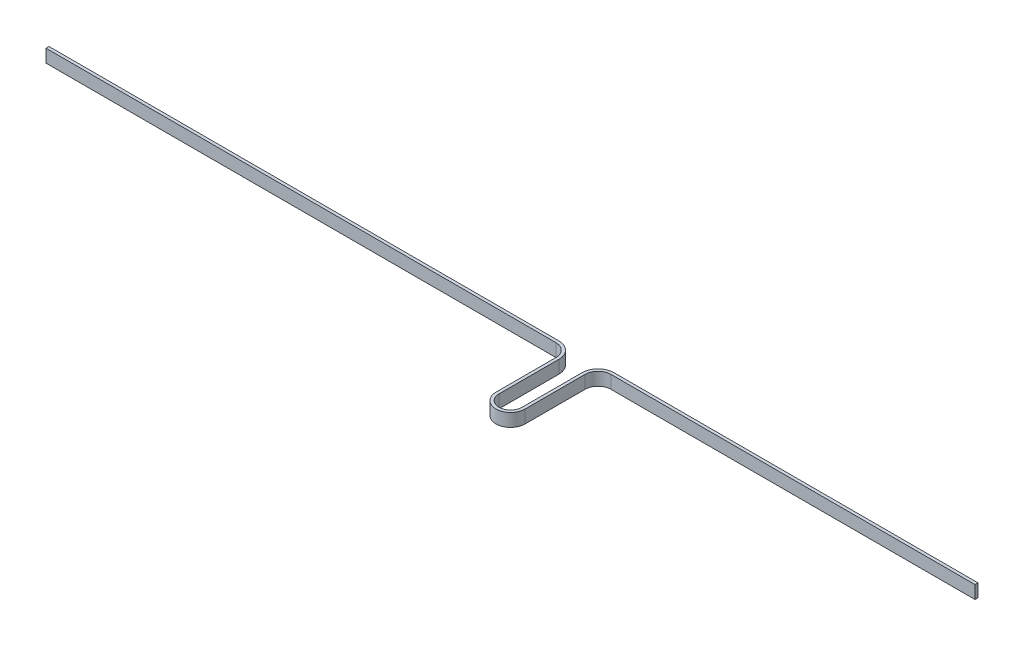
ISO-10303-21;
HEADER;
FILE_DESCRIPTION(('STEP AP214'),'2;1');
FILE_NAME('part.step','',(''),(''),'','','');
FILE_SCHEMA(('AUTOMOTIVE_DESIGN { 1 0 10303 214 1 1 1 1 }'));
ENDSEC;
DATA;
#1=APPLICATION_CONTEXT('core data for automotive mechanical design processes');
#2=APPLICATION_PROTOCOL_DEFINITION('international standard','automotive_design',2000,#1);
#3=PRODUCT_CONTEXT('',#1,'mechanical');
#4=PRODUCT('Part','Part','',(#3));
#5=PRODUCT_RELATED_PRODUCT_CATEGORY('part','',(#4));
#6=PRODUCT_DEFINITION_FORMATION('','',#4);
#7=PRODUCT_DEFINITION_CONTEXT('part definition',#1,'design');
#8=PRODUCT_DEFINITION('design','',#6,#7);
#9=PRODUCT_DEFINITION_SHAPE('','',#8);
#10=(LENGTH_UNIT() NAMED_UNIT(*) SI_UNIT(.MILLI.,.METRE.));
#11=(NAMED_UNIT(*) PLANE_ANGLE_UNIT() SI_UNIT($,.RADIAN.));
#12=(NAMED_UNIT(*) SI_UNIT($,.STERADIAN.) SOLID_ANGLE_UNIT());
#13=UNCERTAINTY_MEASURE_WITH_UNIT(LENGTH_MEASURE(1.E-05),#10,'distance_accuracy_value','');
#14=(GEOMETRIC_REPRESENTATION_CONTEXT(3) GLOBAL_UNCERTAINTY_ASSIGNED_CONTEXT((#13)) GLOBAL_UNIT_ASSIGNED_CONTEXT((#10,
#11,#12)) REPRESENTATION_CONTEXT('',''));
#15=CARTESIAN_POINT('',(0.,0.,0.));
#16=DIRECTION('',(0.,0.,1.));
#17=DIRECTION('',(1.,0.,0.));
#18=AXIS2_PLACEMENT_3D('',#15,#16,#17);
#19=CARTESIAN_POINT('',(363.12,6.,261.023481844307));
#20=DIRECTION('',(0.,0.,-1.));
#21=DIRECTION('',(-1.,0.,0.));
#22=AXIS2_PLACEMENT_3D('',#19,#20,#21);
#23=PLANE('',#22);
#24=DIRECTION('',(1.,0.,0.));
#25=VECTOR('',#24,1.);
#26=CARTESIAN_POINT('',(363.12,0.,261.023481844307));
#27=LINE('',#26,#25);
#28=CARTESIAN_POINT('',(363.12,0.,261.023481844307));
#29=VERTEX_POINT('',#28);
#30=CARTESIAN_POINT('',(531.62539661,0.,261.023481844307));
#31=VERTEX_POINT('',#30);
#32=EDGE_CURVE('E182',#29,#31,#27,.T.);
#33=ORIENTED_EDGE('',*,*,#32,.T.);
#34=DIRECTION('',(0.,-1.,0.));
#35=VECTOR('',#34,1.);
#36=CARTESIAN_POINT('',(531.62539661,6.,261.023481844307));
#37=LINE('',#36,#35);
#38=CARTESIAN_POINT('',(531.62539661,6.,261.023481844307));
#39=VERTEX_POINT('',#38);
#40=EDGE_CURVE('E11',#39,#31,#37,.T.);
#41=ORIENTED_EDGE('',*,*,#40,.F.);
#42=DIRECTION('',(1.,0.,0.));
#43=VECTOR('',#42,1.);
#44=CARTESIAN_POINT('',(363.12,6.,261.023481844307));
#45=LINE('',#44,#43);
#46=CARTESIAN_POINT('',(363.12,6.,261.023481844307));
#47=VERTEX_POINT('',#46);
#48=EDGE_CURVE('E119',#47,#39,#45,.T.);
#49=ORIENTED_EDGE('',*,*,#48,.F.);
#50=DIRECTION('',(0.,-1.,0.));
#51=VECTOR('',#50,1.);
#52=CARTESIAN_POINT('',(363.12,6.,261.023481844307));
#53=LINE('',#52,#51);
#54=EDGE_CURVE('E178',#47,#29,#53,.T.);
#55=ORIENTED_EDGE('',*,*,#54,.T.);
#56=EDGE_LOOP('',(#33,#41,#49,#55));
#57=FACE_BOUND('',#56,.T.);
#58=ADVANCED_FACE('F39',(#57),#23,.F.);
#59=CARTESIAN_POINT('',(531.62539661,6.,259.643481844307));
#60=DIRECTION('',(1.,0.,0.));
#61=DIRECTION('',(0.,0.,-1.));
#62=AXIS2_PLACEMENT_3D('',#59,#60,#61);
#63=PLANE('',#62);
#64=DIRECTION('',(0.,0.,1.));
#65=VECTOR('',#64,1.);
#66=CARTESIAN_POINT('',(531.62539661,0.,259.643481844307));
#67=LINE('',#66,#65);
#68=CARTESIAN_POINT('',(531.62539661,0.,259.643481844307));
#69=VERTEX_POINT('',#68);
#70=EDGE_CURVE('E185',#69,#31,#67,.T.);
#71=ORIENTED_EDGE('',*,*,#70,.F.);
#72=DIRECTION('',(0.,-1.,0.));
#73=VECTOR('',#72,1.);
#74=CARTESIAN_POINT('',(531.62539661,6.,259.643481844307));
#75=LINE('',#74,#73);
#76=CARTESIAN_POINT('',(531.62539661,6.,259.643481844307));
#77=VERTEX_POINT('',#76);
#78=EDGE_CURVE('E47',#77,#69,#75,.T.);
#79=ORIENTED_EDGE('',*,*,#78,.F.);
#80=DIRECTION('',(0.,0.,1.));
#81=VECTOR('',#80,1.);
#82=CARTESIAN_POINT('',(531.62539661,6.,259.643481844307));
#83=LINE('',#82,#81);
#84=EDGE_CURVE('E267',#77,#39,#83,.T.);
#85=ORIENTED_EDGE('',*,*,#84,.T.);
#86=ORIENTED_EDGE('',*,*,#40,.T.);
#87=EDGE_LOOP('',(#71,#79,#85,#86));
#88=FACE_BOUND('',#87,.T.);
#89=ADVANCED_FACE('F254',(#88),#63,.T.);
#90=CARTESIAN_POINT('',(363.12,6.,259.643481844307));
#91=DIRECTION('',(0.,0.,-1.));
#92=DIRECTION('',(-1.,0.,0.));
#93=AXIS2_PLACEMENT_3D('',#90,#91,#92);
#94=PLANE('',#93);
#95=DIRECTION('',(1.,0.,0.));
#96=VECTOR('',#95,1.);
#97=CARTESIAN_POINT('',(363.12,0.,259.643481844307));
#98=LINE('',#97,#96);
#99=CARTESIAN_POINT('',(363.12,0.,259.643481844307));
#100=VERTEX_POINT('',#99);
#101=EDGE_CURVE('E188',#100,#69,#98,.T.);
#102=ORIENTED_EDGE('',*,*,#101,.F.);
#103=DIRECTION('',(0.,-1.,0.));
#104=VECTOR('',#103,1.);
#105=CARTESIAN_POINT('',(363.12,6.,259.643481844307));
#106=LINE('',#105,#104);
#107=CARTESIAN_POINT('',(363.12,6.,259.643481844307));
#108=VERTEX_POINT('',#107);
#109=EDGE_CURVE('E244',#108,#100,#106,.T.);
#110=ORIENTED_EDGE('',*,*,#109,.F.);
#111=DIRECTION('',(1.,0.,0.));
#112=VECTOR('',#111,1.);
#113=CARTESIAN_POINT('',(363.12,6.,259.643481844307));
#114=LINE('',#113,#112);
#115=EDGE_CURVE('E251',#108,#77,#114,.T.);
#116=ORIENTED_EDGE('',*,*,#115,.T.);
#117=ORIENTED_EDGE('',*,*,#78,.T.);
#118=EDGE_LOOP('',(#102,#110,#116,#117));
#119=FACE_BOUND('',#118,.T.);
#120=ADVANCED_FACE('F249',(#119),#94,.T.);
#121=CARTESIAN_POINT('',(363.12,6.,267.017481844307));
#122=DIRECTION('',(0.,-1.,0.));
#123=DIRECTION('',(0.,0.,-1.));
#124=AXIS2_PLACEMENT_3D('',#121,#122,#123);
#125=CYLINDRICAL_SURFACE('',#124,7.37399999999999);
#126=CARTESIAN_POINT('',(363.12,0.,267.017481844307));
#127=DIRECTION('',(0.,1.,0.));
#128=DIRECTION('',(1.,0.,0.));
#129=AXIS2_PLACEMENT_3D('',#126,#127,#128);
#130=CIRCLE('',#129,7.37399999999999);
#131=CARTESIAN_POINT('',(355.746,0.,267.017481844307));
#132=VERTEX_POINT('',#131);
#133=EDGE_CURVE('E191',#132,#100,#130,.F.);
#134=ORIENTED_EDGE('',*,*,#133,.F.);
#135=DIRECTION('',(0.,-1.,0.));
#136=VECTOR('',#135,1.);
#137=CARTESIAN_POINT('',(355.746,6.,267.017481844307));
#138=LINE('',#137,#136);
#139=CARTESIAN_POINT('',(355.746,6.,267.017481844307));
#140=VERTEX_POINT('',#139);
#141=EDGE_CURVE('E242',#140,#132,#138,.T.);
#142=ORIENTED_EDGE('',*,*,#141,.F.);
#143=CARTESIAN_POINT('',(363.12,6.,267.017481844307));
#144=DIRECTION('',(0.,1.,0.));
#145=DIRECTION('',(1.,0.,0.));
#146=AXIS2_PLACEMENT_3D('',#143,#144,#145);
#147=CIRCLE('',#146,7.37399999999999);
#148=EDGE_CURVE('E264',#140,#108,#147,.F.);
#149=ORIENTED_EDGE('',*,*,#148,.T.);
#150=ORIENTED_EDGE('',*,*,#109,.T.);
#151=EDGE_LOOP('',(#134,#142,#149,#150));
#152=FACE_BOUND('',#151,.T.);
#153=ADVANCED_FACE('F261',(#152),#125,.T.);
#154=CARTESIAN_POINT('',(355.746,6.,267.017481844307));
#155=DIRECTION('',(-1.,0.,0.));
#156=DIRECTION('',(0.,0.,1.));
#157=AXIS2_PLACEMENT_3D('',#154,#155,#156);
#158=PLANE('',#157);
#159=DIRECTION('',(0.,0.,-1.));
#160=VECTOR('',#159,1.);
#161=CARTESIAN_POINT('',(355.746,0.,267.017481844307));
#162=LINE('',#161,#160);
#163=CARTESIAN_POINT('',(355.746,0.,294.767481844307));
#164=VERTEX_POINT('',#163);
#165=EDGE_CURVE('E194',#164,#132,#162,.T.);
#166=ORIENTED_EDGE('',*,*,#165,.F.);
#167=DIRECTION('',(0.,-1.,0.));
#168=VECTOR('',#167,1.);
#169=CARTESIAN_POINT('',(355.746,6.,294.767481844307));
#170=LINE('',#169,#168);
#171=CARTESIAN_POINT('',(355.746,6.,294.767481844307));
#172=VERTEX_POINT('',#171);
#173=EDGE_CURVE('E240',#172,#164,#170,.T.);
#174=ORIENTED_EDGE('',*,*,#173,.F.);
#175=DIRECTION('',(0.,0.,-1.));
#176=VECTOR('',#175,1.);
#177=CARTESIAN_POINT('',(355.746,6.,267.017481844307));
#178=LINE('',#177,#176);
#179=EDGE_CURVE('E269',#172,#140,#178,.T.);
#180=ORIENTED_EDGE('',*,*,#179,.T.);
#181=ORIENTED_EDGE('',*,*,#141,.T.);
#182=EDGE_LOOP('',(#166,#174,#180,#181));
#183=FACE_BOUND('',#182,.T.);
#184=ADVANCED_FACE('F326',(#183),#158,.T.);
#185=CARTESIAN_POINT('',(350.38,6.,294.767481844307));
#186=DIRECTION('',(0.,-1.,0.));
#187=DIRECTION('',(0.,0.,-1.));
#188=AXIS2_PLACEMENT_3D('',#185,#186,#187);
#189=CYLINDRICAL_SURFACE('',#188,5.36599999999999);
#190=CARTESIAN_POINT('',(350.38,0.,294.767481844307));
#191=DIRECTION('',(0.,1.,0.));
#192=DIRECTION('',(1.,0.,0.));
#193=AXIS2_PLACEMENT_3D('',#190,#191,#192);
#194=CIRCLE('',#193,5.36599999999999);
#195=CARTESIAN_POINT('',(345.014,0.,294.767481844307));
#196=VERTEX_POINT('',#195);
#197=EDGE_CURVE('E197',#196,#164,#194,.T.);
#198=ORIENTED_EDGE('',*,*,#197,.F.);
#199=DIRECTION('',(0.,-1.,0.));
#200=VECTOR('',#199,1.);
#201=CARTESIAN_POINT('',(345.014,6.,294.767481844307));
#202=LINE('',#201,#200);
#203=CARTESIAN_POINT('',(345.014,6.,294.767481844307));
#204=VERTEX_POINT('',#203);
#205=EDGE_CURVE('E238',#204,#196,#202,.T.);
#206=ORIENTED_EDGE('',*,*,#205,.F.);
#207=CARTESIAN_POINT('',(350.38,6.,294.767481844307));
#208=DIRECTION('',(0.,1.,0.));
#209=DIRECTION('',(1.,0.,0.));
#210=AXIS2_PLACEMENT_3D('',#207,#208,#209);
#211=CIRCLE('',#210,5.36599999999999);
#212=EDGE_CURVE('E275',#204,#172,#211,.T.);
#213=ORIENTED_EDGE('',*,*,#212,.T.);
#214=ORIENTED_EDGE('',*,*,#173,.T.);
#215=EDGE_LOOP('',(#198,#206,#213,#214));
#216=FACE_BOUND('',#215,.T.);
#217=ADVANCED_FACE('F329',(#216),#189,.F.);
#218=CARTESIAN_POINT('',(345.014,6.,294.767481844307));
#219=DIRECTION('',(1.,0.,0.));
#220=DIRECTION('',(0.,0.,-1.));
#221=AXIS2_PLACEMENT_3D('',#218,#219,#220);
#222=PLANE('',#221);
#223=DIRECTION('',(0.,0.,1.));
#224=VECTOR('',#223,1.);
#225=CARTESIAN_POINT('',(345.014,0.,294.767481844307));
#226=LINE('',#225,#224);
#227=CARTESIAN_POINT('',(345.014,0.,267.017481844307));
#228=VERTEX_POINT('',#227);
#229=EDGE_CURVE('E200',#228,#196,#226,.T.);
#230=ORIENTED_EDGE('',*,*,#229,.F.);
#231=DIRECTION('',(0.,-1.,0.));
#232=VECTOR('',#231,1.);
#233=CARTESIAN_POINT('',(345.014,6.,267.017481844307));
#234=LINE('',#233,#232);
#235=CARTESIAN_POINT('',(345.014,6.,267.017481844307));
#236=VERTEX_POINT('',#235);
#237=EDGE_CURVE('E236',#236,#228,#234,.T.);
#238=ORIENTED_EDGE('',*,*,#237,.F.);
#239=DIRECTION('',(0.,0.,1.));
#240=VECTOR('',#239,1.);
#241=CARTESIAN_POINT('',(345.014,6.,294.767481844307));
#242=LINE('',#241,#240);
#243=EDGE_CURVE('E278',#236,#204,#242,.T.);
#244=ORIENTED_EDGE('',*,*,#243,.T.);
#245=ORIENTED_EDGE('',*,*,#205,.T.);
#246=EDGE_LOOP('',(#230,#238,#244,#245));
#247=FACE_BOUND('',#246,.T.);
#248=ADVANCED_FACE('F333',(#247),#222,.T.);
#249=CARTESIAN_POINT('',(337.64,6.,267.017481844307));
#250=DIRECTION('',(0.,-1.,0.));
#251=DIRECTION('',(0.,0.,-1.));
#252=AXIS2_PLACEMENT_3D('',#249,#250,#251);
#253=CYLINDRICAL_SURFACE('',#252,7.37399999999996);
#254=CARTESIAN_POINT('',(337.64,0.,267.017481844307));
#255=DIRECTION('',(0.,1.,0.));
#256=DIRECTION('',(1.,0.,0.));
#257=AXIS2_PLACEMENT_3D('',#254,#255,#256);
#258=CIRCLE('',#257,7.37399999999996);
#259=CARTESIAN_POINT('',(337.64,0.,259.643481844308));
#260=VERTEX_POINT('',#259);
#261=EDGE_CURVE('E203',#260,#228,#258,.F.);
#262=ORIENTED_EDGE('',*,*,#261,.F.);
#263=DIRECTION('',(0.,-1.,0.));
#264=VECTOR('',#263,1.);
#265=CARTESIAN_POINT('',(337.64,6.,259.643481844308));
#266=LINE('',#265,#264);
#267=CARTESIAN_POINT('',(337.64,6.,259.643481844308));
#268=VERTEX_POINT('',#267);
#269=EDGE_CURVE('E234',#268,#260,#266,.T.);
#270=ORIENTED_EDGE('',*,*,#269,.F.);
#271=CARTESIAN_POINT('',(337.64,6.,267.017481844307));
#272=DIRECTION('',(0.,1.,0.));
#273=DIRECTION('',(1.,0.,0.));
#274=AXIS2_PLACEMENT_3D('',#271,#272,#273);
#275=CIRCLE('',#274,7.37399999999996);
#276=EDGE_CURVE('E281',#268,#236,#275,.F.);
#277=ORIENTED_EDGE('',*,*,#276,.T.);
#278=ORIENTED_EDGE('',*,*,#237,.T.);
#279=EDGE_LOOP('',(#262,#270,#277,#278));
#280=FACE_BOUND('',#279,.T.);
#281=ADVANCED_FACE('F337',(#280),#253,.T.);
#282=CARTESIAN_POINT('',(337.64,6.,259.643481844307));
#283=DIRECTION('',(0.,0.,-1.));
#284=DIRECTION('',(-1.,0.,0.));
#285=AXIS2_PLACEMENT_3D('',#282,#283,#284);
#286=PLANE('',#285);
#287=DIRECTION('',(1.,0.,0.));
#288=VECTOR('',#287,1.);
#289=CARTESIAN_POINT('',(337.64,0.,259.643481844307));
#290=LINE('',#289,#288);
#291=CARTESIAN_POINT('',(101.625,0.,259.643481844308));
#292=VERTEX_POINT('',#291);
#293=EDGE_CURVE('E206',#292,#260,#290,.T.);
#294=ORIENTED_EDGE('',*,*,#293,.F.);
#295=DIRECTION('',(0.,-1.,0.));
#296=VECTOR('',#295,1.);
#297=CARTESIAN_POINT('',(101.625,6.,259.643481844308));
#298=LINE('',#297,#296);
#299=CARTESIAN_POINT('',(101.625,6.,259.643481844308));
#300=VERTEX_POINT('',#299);
#301=EDGE_CURVE('E232',#300,#292,#298,.T.);
#302=ORIENTED_EDGE('',*,*,#301,.F.);
#303=DIRECTION('',(1.,0.,0.));
#304=VECTOR('',#303,1.);
#305=CARTESIAN_POINT('',(337.64,6.,259.643481844307));
#306=LINE('',#305,#304);
#307=EDGE_CURVE('E284',#300,#268,#306,.T.);
#308=ORIENTED_EDGE('',*,*,#307,.T.);
#309=ORIENTED_EDGE('',*,*,#269,.T.);
#310=EDGE_LOOP('',(#294,#302,#308,#309));
#311=FACE_BOUND('',#310,.T.);
#312=ADVANCED_FACE('F341',(#311),#286,.T.);
#313=CARTESIAN_POINT('',(101.625,6.,261.023481844308));
#314=DIRECTION('',(-1.,0.,0.));
#315=DIRECTION('',(0.,0.,1.));
#316=AXIS2_PLACEMENT_3D('',#313,#314,#315);
#317=PLANE('',#316);
#318=DIRECTION('',(0.,0.,-1.));
#319=VECTOR('',#318,1.);
#320=CARTESIAN_POINT('',(101.625,0.,261.023481844308));
#321=LINE('',#320,#319);
#322=CARTESIAN_POINT('',(101.625,0.,261.023481844308));
#323=VERTEX_POINT('',#322);
#324=EDGE_CURVE('E209',#323,#292,#321,.T.);
#325=ORIENTED_EDGE('',*,*,#324,.F.);
#326=DIRECTION('',(0.,-1.,0.));
#327=VECTOR('',#326,1.);
#328=CARTESIAN_POINT('',(101.625,6.,261.023481844308));
#329=LINE('',#328,#327);
#330=CARTESIAN_POINT('',(101.625,6.,261.023481844308));
#331=VERTEX_POINT('',#330);
#332=EDGE_CURVE('E230',#331,#323,#329,.T.);
#333=ORIENTED_EDGE('',*,*,#332,.F.);
#334=DIRECTION('',(0.,0.,-1.));
#335=VECTOR('',#334,1.);
#336=CARTESIAN_POINT('',(101.625,6.,261.023481844308));
#337=LINE('',#336,#335);
#338=EDGE_CURVE('E287',#331,#300,#337,.T.);
#339=ORIENTED_EDGE('',*,*,#338,.T.);
#340=ORIENTED_EDGE('',*,*,#301,.T.);
#341=EDGE_LOOP('',(#325,#333,#339,#340));
#342=FACE_BOUND('',#341,.T.);
#343=ADVANCED_FACE('F345',(#342),#317,.T.);
#344=CARTESIAN_POINT('',(337.64,6.,261.023481844307));
#345=DIRECTION('',(0.,0.,-1.));
#346=DIRECTION('',(-1.,0.,0.));
#347=AXIS2_PLACEMENT_3D('',#344,#345,#346);
#348=PLANE('',#347);
#349=DIRECTION('',(1.,0.,0.));
#350=VECTOR('',#349,1.);
#351=CARTESIAN_POINT('',(337.64,0.,261.023481844307));
#352=LINE('',#351,#350);
#353=CARTESIAN_POINT('',(337.64,0.,261.023481844308));
#354=VERTEX_POINT('',#353);
#355=EDGE_CURVE('E212',#323,#354,#352,.T.);
#356=ORIENTED_EDGE('',*,*,#355,.T.);
#357=DIRECTION('',(0.,-1.,0.));
#358=VECTOR('',#357,1.);
#359=CARTESIAN_POINT('',(337.64,6.,261.023481844308));
#360=LINE('',#359,#358);
#361=CARTESIAN_POINT('',(337.64,6.,261.023481844308));
#362=VERTEX_POINT('',#361);
#363=EDGE_CURVE('E227',#362,#354,#360,.T.);
#364=ORIENTED_EDGE('',*,*,#363,.F.);
#365=DIRECTION('',(1.,0.,0.));
#366=VECTOR('',#365,1.);
#367=CARTESIAN_POINT('',(337.64,6.,261.023481844307));
#368=LINE('',#367,#366);
#369=EDGE_CURVE('E290',#331,#362,#368,.T.);
#370=ORIENTED_EDGE('',*,*,#369,.F.);
#371=ORIENTED_EDGE('',*,*,#332,.T.);
#372=EDGE_LOOP('',(#356,#364,#370,#371));
#373=FACE_BOUND('',#372,.T.);
#374=ADVANCED_FACE('F349',(#373),#348,.F.);
#375=CARTESIAN_POINT('',(337.64,6.,267.017481844307));
#376=DIRECTION('',(0.,-1.,0.));
#377=DIRECTION('',(0.,0.,-1.));
#378=AXIS2_PLACEMENT_3D('',#375,#376,#377);
#379=CYLINDRICAL_SURFACE('',#378,5.99399999999996);
#380=CARTESIAN_POINT('',(337.64,0.,267.017481844307));
#381=DIRECTION('',(0.,1.,0.));
#382=DIRECTION('',(1.,0.,0.));
#383=AXIS2_PLACEMENT_3D('',#380,#381,#382);
#384=CIRCLE('',#383,5.99399999999996);
#385=CARTESIAN_POINT('',(343.634,0.,267.017481844307));
#386=VERTEX_POINT('',#385);
#387=EDGE_CURVE('E214',#354,#386,#384,.F.);
#388=ORIENTED_EDGE('',*,*,#387,.T.);
#389=DIRECTION('',(0.,-1.,0.));
#390=VECTOR('',#389,1.);
#391=CARTESIAN_POINT('',(343.634,6.,267.017481844307));
#392=LINE('',#391,#390);
#393=CARTESIAN_POINT('',(343.634,6.,267.017481844307));
#394=VERTEX_POINT('',#393);
#395=EDGE_CURVE('E224',#394,#386,#392,.T.);
#396=ORIENTED_EDGE('',*,*,#395,.F.);
#397=CARTESIAN_POINT('',(337.64,6.,267.017481844307));
#398=DIRECTION('',(0.,1.,0.));
#399=DIRECTION('',(1.,0.,0.));
#400=AXIS2_PLACEMENT_3D('',#397,#398,#399);
#401=CIRCLE('',#400,5.99399999999996);
#402=EDGE_CURVE('E292',#362,#394,#401,.F.);
#403=ORIENTED_EDGE('',*,*,#402,.F.);
#404=ORIENTED_EDGE('',*,*,#363,.T.);
#405=EDGE_LOOP('',(#388,#396,#403,#404));
#406=FACE_BOUND('',#405,.T.);
#407=ADVANCED_FACE('F299',(#406),#379,.F.);
#408=CARTESIAN_POINT('',(343.634,6.,294.767481844307));
#409=DIRECTION('',(1.,0.,0.));
#410=DIRECTION('',(0.,0.,-1.));
#411=AXIS2_PLACEMENT_3D('',#408,#409,#410);
#412=PLANE('',#411);
#413=DIRECTION('',(0.,0.,1.));
#414=VECTOR('',#413,1.);
#415=CARTESIAN_POINT('',(343.634,0.,294.767481844307));
#416=LINE('',#415,#414);
#417=CARTESIAN_POINT('',(343.634,0.,294.767481844307));
#418=VERTEX_POINT('',#417);
#419=EDGE_CURVE('E216',#386,#418,#416,.T.);
#420=ORIENTED_EDGE('',*,*,#419,.T.);
#421=DIRECTION('',(0.,-1.,0.));
#422=VECTOR('',#421,1.);
#423=CARTESIAN_POINT('',(343.634,6.,294.767481844307));
#424=LINE('',#423,#422);
#425=CARTESIAN_POINT('',(343.634,6.,294.767481844307));
#426=VERTEX_POINT('',#425);
#427=EDGE_CURVE('E173',#426,#418,#424,.T.);
#428=ORIENTED_EDGE('',*,*,#427,.F.);
#429=DIRECTION('',(0.,0.,1.));
#430=VECTOR('',#429,1.);
#431=CARTESIAN_POINT('',(343.634,6.,294.767481844307));
#432=LINE('',#431,#430);
#433=EDGE_CURVE('E164',#394,#426,#432,.T.);
#434=ORIENTED_EDGE('',*,*,#433,.F.);
#435=ORIENTED_EDGE('',*,*,#395,.T.);
#436=EDGE_LOOP('',(#420,#428,#434,#435));
#437=FACE_BOUND('',#436,.T.);
#438=ADVANCED_FACE('F303',(#437),#412,.F.);
#439=CARTESIAN_POINT('',(350.38,6.,294.767481844307));
#440=DIRECTION('',(0.,-1.,0.));
#441=DIRECTION('',(0.,0.,-1.));
#442=AXIS2_PLACEMENT_3D('',#439,#440,#441);
#443=CYLINDRICAL_SURFACE('',#442,6.74599999999999);
#444=CARTESIAN_POINT('',(350.38,0.,294.767481844307));
#445=DIRECTION('',(0.,1.,0.));
#446=DIRECTION('',(1.,0.,0.));
#447=AXIS2_PLACEMENT_3D('',#444,#445,#446);
#448=CIRCLE('',#447,6.74599999999999);
#449=CARTESIAN_POINT('',(357.126,0.,294.767481844307));
#450=VERTEX_POINT('',#449);
#451=EDGE_CURVE('E172',#418,#450,#448,.T.);
#452=ORIENTED_EDGE('',*,*,#451,.T.);
#453=DIRECTION('',(0.,-1.,0.));
#454=VECTOR('',#453,1.);
#455=CARTESIAN_POINT('',(357.126,6.,294.767481844307));
#456=LINE('',#455,#454);
#457=CARTESIAN_POINT('',(357.126,6.,294.767481844307));
#458=VERTEX_POINT('',#457);
#459=EDGE_CURVE('E169',#458,#450,#456,.T.);
#460=ORIENTED_EDGE('',*,*,#459,.F.);
#461=CARTESIAN_POINT('',(350.38,6.,294.767481844307));
#462=DIRECTION('',(0.,1.,0.));
#463=DIRECTION('',(1.,0.,0.));
#464=AXIS2_PLACEMENT_3D('',#461,#462,#463);
#465=CIRCLE('',#464,6.74599999999999);
#466=EDGE_CURVE('E158',#426,#458,#465,.T.);
#467=ORIENTED_EDGE('',*,*,#466,.F.);
#468=ORIENTED_EDGE('',*,*,#427,.T.);
#469=EDGE_LOOP('',(#452,#460,#467,#468));
#470=FACE_BOUND('',#469,.T.);
#471=ADVANCED_FACE('F170',(#470),#443,.T.);
#472=CARTESIAN_POINT('',(357.126,6.,267.017481844307));
#473=DIRECTION('',(-1.,0.,0.));
#474=DIRECTION('',(0.,0.,1.));
#475=AXIS2_PLACEMENT_3D('',#472,#473,#474);
#476=PLANE('',#475);
#477=DIRECTION('',(0.,0.,-1.));
#478=VECTOR('',#477,1.);
#479=CARTESIAN_POINT('',(357.126,0.,267.017481844307));
#480=LINE('',#479,#478);
#481=CARTESIAN_POINT('',(357.126,0.,267.017481844307));
#482=VERTEX_POINT('',#481);
#483=EDGE_CURVE('E107',#450,#482,#480,.T.);
#484=ORIENTED_EDGE('',*,*,#483,.T.);
#485=DIRECTION('',(0.,-1.,0.));
#486=VECTOR('',#485,1.);
#487=CARTESIAN_POINT('',(357.126,6.,267.017481844307));
#488=LINE('',#487,#486);
#489=CARTESIAN_POINT('',(357.126,6.,267.017481844307));
#490=VERTEX_POINT('',#489);
#491=EDGE_CURVE('E174',#490,#482,#488,.T.);
#492=ORIENTED_EDGE('',*,*,#491,.F.);
#493=DIRECTION('',(0.,0.,-1.));
#494=VECTOR('',#493,1.);
#495=CARTESIAN_POINT('',(357.126,6.,267.017481844307));
#496=LINE('',#495,#494);
#497=EDGE_CURVE('E162',#458,#490,#496,.T.);
#498=ORIENTED_EDGE('',*,*,#497,.F.);
#499=ORIENTED_EDGE('',*,*,#459,.T.);
#500=EDGE_LOOP('',(#484,#492,#498,#499));
#501=FACE_BOUND('',#500,.T.);
#502=ADVANCED_FACE('F176',(#501),#476,.F.);
#503=CARTESIAN_POINT('',(363.12,6.,267.017481844307));
#504=DIRECTION('',(0.,-1.,0.));
#505=DIRECTION('',(0.,0.,-1.));
#506=AXIS2_PLACEMENT_3D('',#503,#504,#505);
#507=CYLINDRICAL_SURFACE('',#506,5.99399999999999);
#508=CARTESIAN_POINT('',(363.12,0.,267.017481844307));
#509=DIRECTION('',(0.,1.,0.));
#510=DIRECTION('',(1.,0.,0.));
#511=AXIS2_PLACEMENT_3D('',#508,#509,#510);
#512=CIRCLE('',#511,5.99399999999999);
#513=EDGE_CURVE('E113',#482,#29,#512,.F.);
#514=ORIENTED_EDGE('',*,*,#513,.T.);
#515=ORIENTED_EDGE('',*,*,#54,.F.);
#516=CARTESIAN_POINT('',(363.12,6.,267.017481844307));
#517=DIRECTION('',(0.,1.,0.));
#518=DIRECTION('',(1.,0.,0.));
#519=AXIS2_PLACEMENT_3D('',#516,#517,#518);
#520=CIRCLE('',#519,5.99399999999999);
#521=EDGE_CURVE('E55',#490,#47,#520,.F.);
#522=ORIENTED_EDGE('',*,*,#521,.F.);
#523=ORIENTED_EDGE('',*,*,#491,.T.);
#524=EDGE_LOOP('',(#514,#515,#522,#523));
#525=FACE_BOUND('',#524,.T.);
#526=ADVANCED_FACE('F305',(#525),#507,.F.);
#527=CARTESIAN_POINT('',(363.12,6.,267.017481844307));
#528=DIRECTION('',(0.,1.,0.));
#529=DIRECTION('',(1.,0.,0.));
#530=AXIS2_PLACEMENT_3D('',#527,#528,#529);
#531=PLANE('',#530);
#532=ORIENTED_EDGE('',*,*,#48,.T.);
#533=ORIENTED_EDGE('',*,*,#84,.F.);
#534=ORIENTED_EDGE('',*,*,#115,.F.);
#535=ORIENTED_EDGE('',*,*,#148,.F.);
#536=ORIENTED_EDGE('',*,*,#179,.F.);
#537=ORIENTED_EDGE('',*,*,#212,.F.);
#538=ORIENTED_EDGE('',*,*,#243,.F.);
#539=ORIENTED_EDGE('',*,*,#276,.F.);
#540=ORIENTED_EDGE('',*,*,#307,.F.);
#541=ORIENTED_EDGE('',*,*,#338,.F.);
#542=ORIENTED_EDGE('',*,*,#369,.T.);
#543=ORIENTED_EDGE('',*,*,#402,.T.);
#544=ORIENTED_EDGE('',*,*,#433,.T.);
#545=ORIENTED_EDGE('',*,*,#466,.T.);
#546=ORIENTED_EDGE('',*,*,#497,.T.);
#547=ORIENTED_EDGE('',*,*,#521,.T.);
#548=EDGE_LOOP('',(#532,#533,#534,#535,#536,#537,#538,#539,#540,#541,#542,#543,#544,#545,#546,#547));
#549=FACE_BOUND('',#548,.T.);
#550=ADVANCED_FACE('F160',(#549),#531,.T.);
#551=CARTESIAN_POINT('',(363.12,0.,267.017481844307));
#552=DIRECTION('',(0.,1.,0.));
#553=DIRECTION('',(1.,0.,0.));
#554=AXIS2_PLACEMENT_3D('',#551,#552,#553);
#555=PLANE('',#554);
#556=ORIENTED_EDGE('',*,*,#32,.F.);
#557=ORIENTED_EDGE('',*,*,#513,.F.);
#558=ORIENTED_EDGE('',*,*,#483,.F.);
#559=ORIENTED_EDGE('',*,*,#451,.F.);
#560=ORIENTED_EDGE('',*,*,#419,.F.);
#561=ORIENTED_EDGE('',*,*,#387,.F.);
#562=ORIENTED_EDGE('',*,*,#355,.F.);
#563=ORIENTED_EDGE('',*,*,#324,.T.);
#564=ORIENTED_EDGE('',*,*,#293,.T.);
#565=ORIENTED_EDGE('',*,*,#261,.T.);
#566=ORIENTED_EDGE('',*,*,#229,.T.);
#567=ORIENTED_EDGE('',*,*,#197,.T.);
#568=ORIENTED_EDGE('',*,*,#165,.T.);
#569=ORIENTED_EDGE('',*,*,#133,.T.);
#570=ORIENTED_EDGE('',*,*,#101,.T.);
#571=ORIENTED_EDGE('',*,*,#70,.T.);
#572=EDGE_LOOP('',(#556,#557,#558,#559,#560,#561,#562,#563,#564,#565,#566,#567,#568,#569,#570,#571));
#573=FACE_BOUND('',#572,.T.);
#574=ADVANCED_FACE('F257',(#573),#555,.F.);
#575=CLOSED_SHELL('',(#58,#89,#120,#153,#184,#217,#248,#281,#312,#343,#374,#407,#438,#471,#502,
#526,#550,#574));
#576=MANIFOLD_SOLID_BREP('B2',#575);
#577=ADVANCED_BREP_SHAPE_REPRESENTATION('',(#18,#576),#14);
#578=SHAPE_DEFINITION_REPRESENTATION(#9,#577);
ENDSEC;
END-ISO-10303-21;
